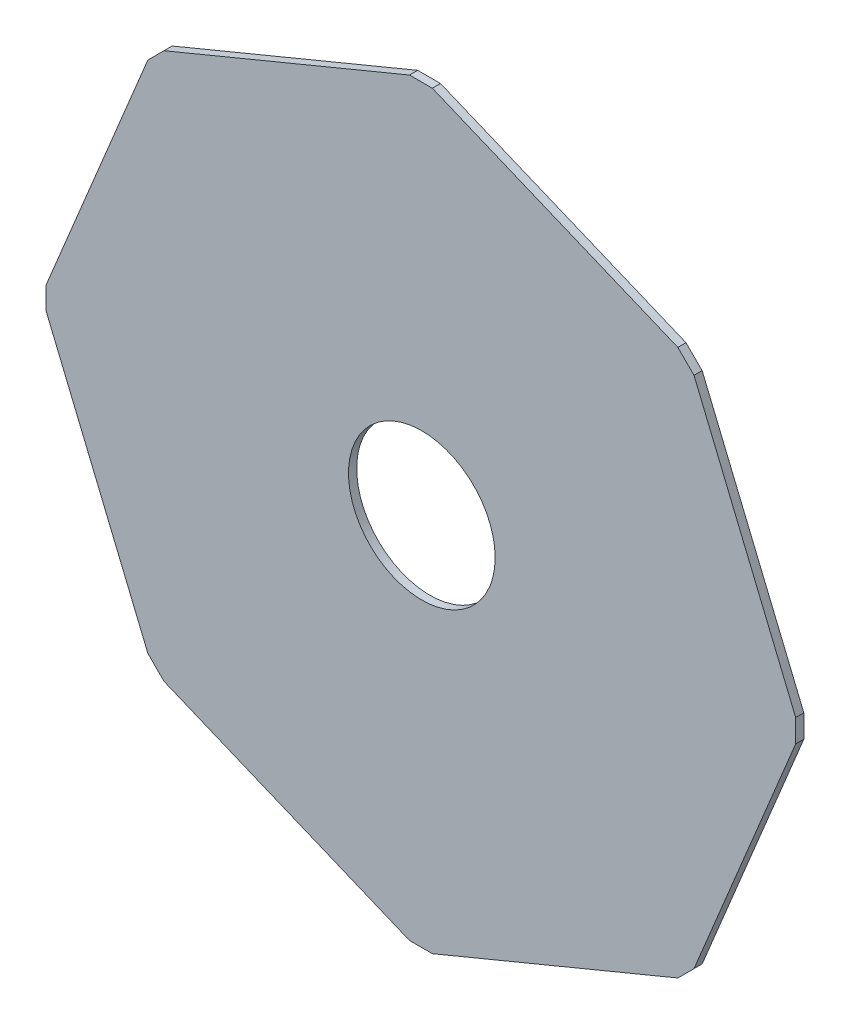
ISO-10303-21;
HEADER;
FILE_DESCRIPTION(('STEP AP214'),'2;1');
FILE_NAME('part.step','',(''),(''),'','','');
FILE_SCHEMA(('AUTOMOTIVE_DESIGN { 1 0 10303 214 1 1 1 1 }'));
ENDSEC;
DATA;
#1=APPLICATION_CONTEXT('core data for automotive mechanical design processes');
#2=APPLICATION_PROTOCOL_DEFINITION('international standard','automotive_design',2000,#1);
#3=PRODUCT_CONTEXT('',#1,'mechanical');
#4=PRODUCT('Part','Part','',(#3));
#5=PRODUCT_RELATED_PRODUCT_CATEGORY('part','',(#4));
#6=PRODUCT_DEFINITION_FORMATION('','',#4);
#7=PRODUCT_DEFINITION_CONTEXT('part definition',#1,'design');
#8=PRODUCT_DEFINITION('design','',#6,#7);
#9=PRODUCT_DEFINITION_SHAPE('','',#8);
#10=(LENGTH_UNIT() NAMED_UNIT(*) SI_UNIT(.MILLI.,.METRE.));
#11=(NAMED_UNIT(*) PLANE_ANGLE_UNIT() SI_UNIT($,.RADIAN.));
#12=(NAMED_UNIT(*) SI_UNIT($,.STERADIAN.) SOLID_ANGLE_UNIT());
#13=UNCERTAINTY_MEASURE_WITH_UNIT(LENGTH_MEASURE(1.E-05),#10,'distance_accuracy_value','');
#14=(GEOMETRIC_REPRESENTATION_CONTEXT(3) GLOBAL_UNCERTAINTY_ASSIGNED_CONTEXT((#13)) GLOBAL_UNIT_ASSIGNED_CONTEXT((#10,
#11,#12)) REPRESENTATION_CONTEXT('',''));
#15=CARTESIAN_POINT('',(0.,0.,0.));
#16=DIRECTION('',(0.,0.,1.));
#17=DIRECTION('',(1.,0.,0.));
#18=AXIS2_PLACEMENT_3D('',#15,#16,#17);
#19=CARTESIAN_POINT('',(0.,0.,5.));
#20=DIRECTION('',(0.,0.,1.));
#21=DIRECTION('',(1.,0.,0.));
#22=AXIS2_PLACEMENT_3D('',#19,#20,#21);
#23=PLANE('',#22);
#24=DIRECTION('',(0.,-1.,0.));
#25=VECTOR('',#24,1.);
#26=CARTESIAN_POINT('',(-230.557942617036,7.27897130849087,5.));
#27=LINE('',#26,#25);
#28=CARTESIAN_POINT('',(-230.557942617036,7.27897130849087,5.));
#29=VERTEX_POINT('',#28);
#30=CARTESIAN_POINT('',(-230.557942617036,-6.7210286914996,5.));
#31=VERTEX_POINT('',#30);
#32=EDGE_CURVE('E211',#29,#31,#27,.T.);
#33=ORIENTED_EDGE('',*,*,#32,.T.);
#34=DIRECTION('',(0.382683432365128,-0.923879532511271,0.));
#35=VECTOR('',#34,1.);
#36=CARTESIAN_POINT('',(-230.557942617036,-6.7210286914996,5.));
#37=LINE('',#36,#35);
#38=CARTESIAN_POINT('',(-168.142249758237,-157.405840896109,5.));
#39=VERTEX_POINT('',#38);
#40=EDGE_CURVE('E119',#31,#39,#37,.T.);
#41=ORIENTED_EDGE('',*,*,#40,.T.);
#42=DIRECTION('',(0.707106781186801,-0.707106781186294,0.));
#43=VECTOR('',#42,1.);
#44=CARTESIAN_POINT('',(-168.142249758237,-157.405840896109,5.));
#45=LINE('',#44,#43);
#46=CARTESIAN_POINT('',(-158.242754821622,-167.305335832717,5.));
#47=VERTEX_POINT('',#46);
#48=EDGE_CURVE('E250',#39,#47,#45,.T.);
#49=ORIENTED_EDGE('',*,*,#48,.T.);
#50=DIRECTION('',(0.923879532511295,-0.382683432365069,0.));
#51=VECTOR('',#50,1.);
#52=CARTESIAN_POINT('',(-158.242754821622,-167.305335832717,5.));
#53=LINE('',#52,#51);
#54=CARTESIAN_POINT('',(-7.55794261702294,-229.721028691501,5.));
#55=VERTEX_POINT('',#54);
#56=EDGE_CURVE('E269',#47,#55,#53,.T.);
#57=ORIENTED_EDGE('',*,*,#56,.T.);
#58=DIRECTION('',(1.,0.,0.));
#59=VECTOR('',#58,1.);
#60=CARTESIAN_POINT('',(-7.55794261702294,-229.721028691501,5.));
#61=LINE('',#60,#59);
#62=CARTESIAN_POINT('',(6.4420573829764,-229.721028691501,5.));
#63=VERTEX_POINT('',#62);
#64=EDGE_CURVE('E266',#55,#63,#61,.T.);
#65=ORIENTED_EDGE('',*,*,#64,.T.);
#66=DIRECTION('',(0.923879532511268,0.382683432365135,0.));
#67=VECTOR('',#66,1.);
#68=CARTESIAN_POINT('',(6.4420573829764,-229.721028691501,5.));
#69=LINE('',#68,#67);
#70=CARTESIAN_POINT('',(157.126869587579,-167.305335832703,5.));
#71=VERTEX_POINT('',#70);
#72=EDGE_CURVE('E268',#63,#71,#69,.T.);
#73=ORIENTED_EDGE('',*,*,#72,.T.);
#74=DIRECTION('',(0.707106781186548,0.707106781186548,0.));
#75=VECTOR('',#74,1.);
#76=CARTESIAN_POINT('',(157.126869587579,-167.305335832703,5.));
#77=LINE('',#76,#75);
#78=CARTESIAN_POINT('',(167.026364524185,-157.405840896097,5.));
#79=VERTEX_POINT('',#78);
#80=EDGE_CURVE('E271',#71,#79,#77,.T.);
#81=ORIENTED_EDGE('',*,*,#80,.T.);
#82=DIRECTION('',(0.382683432365019,0.923879532511316,0.));
#83=VECTOR('',#82,1.);
#84=CARTESIAN_POINT('',(167.026364524185,-157.405840896097,5.));
#85=LINE('',#84,#83);
#86=CARTESIAN_POINT('',(229.442057382966,-6.72102869148158,5.));
#87=VERTEX_POINT('',#86);
#88=EDGE_CURVE('E277',#79,#87,#85,.T.);
#89=ORIENTED_EDGE('',*,*,#88,.T.);
#90=DIRECTION('',(0.,1.,0.));
#91=VECTOR('',#90,1.);
#92=CARTESIAN_POINT('',(229.442057382966,-6.72102869148158,5.));
#93=LINE('',#92,#91);
#94=CARTESIAN_POINT('',(229.442057382966,7.27897130850405,5.));
#95=VERTEX_POINT('',#94);
#96=EDGE_CURVE('E279',#87,#95,#93,.T.);
#97=ORIENTED_EDGE('',*,*,#96,.T.);
#98=DIRECTION('',(-0.38268343236497,0.923879532511336,0.));
#99=VECTOR('',#98,1.);
#100=CARTESIAN_POINT('',(229.442057382966,7.27897130850405,5.));
#101=LINE('',#100,#99);
#102=CARTESIAN_POINT('',(167.026364524201,157.963783513104,5.));
#103=VERTEX_POINT('',#102);
#104=EDGE_CURVE('E281',#95,#103,#101,.T.);
#105=ORIENTED_EDGE('',*,*,#104,.T.);
#106=DIRECTION('',(-0.707106781186548,0.707106781186548,0.));
#107=VECTOR('',#106,1.);
#108=CARTESIAN_POINT('',(167.026364524201,157.963783513104,5.));
#109=LINE('',#108,#107);
#110=CARTESIAN_POINT('',(157.126869587596,167.863278449709,5.));
#111=VERTEX_POINT('',#110);
#112=EDGE_CURVE('E283',#103,#111,#109,.T.);
#113=ORIENTED_EDGE('',*,*,#112,.T.);
#114=DIRECTION('',(-0.923879532511311,0.38268343236503,0.));
#115=VECTOR('',#114,1.);
#116=CARTESIAN_POINT('',(157.126869587596,167.863278449709,5.));
#117=LINE('',#116,#115);
#118=CARTESIAN_POINT('',(6.44205738297554,230.278971308494,5.));
#119=VERTEX_POINT('',#118);
#120=EDGE_CURVE('E285',#111,#119,#117,.T.);
#121=ORIENTED_EDGE('',*,*,#120,.T.);
#122=DIRECTION('',(-1.,0.,0.));
#123=VECTOR('',#122,1.);
#124=CARTESIAN_POINT('',(6.44205738297554,230.278971308494,5.));
#125=LINE('',#124,#123);
#126=CARTESIAN_POINT('',(-7.55794261702026,230.278971308494,5.));
#127=VERTEX_POINT('',#126);
#128=EDGE_CURVE('E162',#119,#127,#125,.T.);
#129=ORIENTED_EDGE('',*,*,#128,.T.);
#130=DIRECTION('',(-0.923879532511271,-0.382683432365128,0.));
#131=VECTOR('',#130,1.);
#132=CARTESIAN_POINT('',(-7.55794261702026,230.278971308494,5.));
#133=LINE('',#132,#131);
#134=CARTESIAN_POINT('',(-158.24275482163,167.863278449695,5.));
#135=VERTEX_POINT('',#134);
#136=EDGE_CURVE('E156',#127,#135,#133,.T.);
#137=ORIENTED_EDGE('',*,*,#136,.T.);
#138=DIRECTION('',(-0.707106781186548,-0.707106781186548,0.));
#139=VECTOR('',#138,1.);
#140=CARTESIAN_POINT('',(-158.24275482163,167.863278449695,5.));
#141=LINE('',#140,#139);
#142=CARTESIAN_POINT('',(-168.142249758279,157.963783513045,5.));
#143=VERTEX_POINT('',#142);
#144=EDGE_CURVE('E160',#135,#143,#141,.T.);
#145=ORIENTED_EDGE('',*,*,#144,.T.);
#146=DIRECTION('',(-0.382683432365024,-0.923879532511314,0.));
#147=VECTOR('',#146,1.);
#148=CARTESIAN_POINT('',(-168.142249758279,157.963783513045,5.));
#149=LINE('',#148,#147);
#150=EDGE_CURVE('E52',#143,#29,#149,.T.);
#151=ORIENTED_EDGE('',*,*,#150,.T.);
#152=EDGE_LOOP('',(#33,#41,#49,#57,#65,#73,#81,#89,#97,#105,#113,#121,#129,#137,#145,#151));
#153=FACE_BOUND('',#152,.T.);
#154=CARTESIAN_POINT('',(0.,0.,5.));
#155=DIRECTION('',(0.,0.,1.));
#156=DIRECTION('',(1.,0.,0.));
#157=AXIS2_PLACEMENT_3D('',#154,#155,#156);
#158=CIRCLE('',#157,45.);
#159=CARTESIAN_POINT('',(45.,0.,5.));
#160=VERTEX_POINT('',#159);
#161=EDGE_CURVE('E184',#160,#160,#158,.T.);
#162=ORIENTED_EDGE('',*,*,#161,.F.);
#163=EDGE_LOOP('',(#162));
#164=FACE_BOUND('',#163,.T.);
#165=ADVANCED_FACE('F35',(#153,#164),#23,.T.);
#166=CARTESIAN_POINT('',(0.,0.,0.));
#167=DIRECTION('',(0.,0.,1.));
#168=DIRECTION('',(1.,0.,0.));
#169=AXIS2_PLACEMENT_3D('',#166,#167,#168);
#170=PLANE('',#169);
#171=DIRECTION('',(0.,-1.,0.));
#172=VECTOR('',#171,1.);
#173=CARTESIAN_POINT('',(-230.557942617036,7.27897130849087,0.));
#174=LINE('',#173,#172);
#175=CARTESIAN_POINT('',(-230.557942617036,7.27897130849087,0.));
#176=VERTEX_POINT('',#175);
#177=CARTESIAN_POINT('',(-230.557942617036,-6.7210286914996,0.));
#178=VERTEX_POINT('',#177);
#179=EDGE_CURVE('E180',#176,#178,#174,.T.);
#180=ORIENTED_EDGE('',*,*,#179,.F.);
#181=DIRECTION('',(-0.382683432365024,-0.923879532511314,0.));
#182=VECTOR('',#181,1.);
#183=CARTESIAN_POINT('',(-168.142249758279,157.963783513045,0.));
#184=LINE('',#183,#182);
#185=CARTESIAN_POINT('',(-168.142249758279,157.963783513045,0.));
#186=VERTEX_POINT('',#185);
#187=EDGE_CURVE('E111',#186,#176,#184,.T.);
#188=ORIENTED_EDGE('',*,*,#187,.F.);
#189=DIRECTION('',(-0.707106781186548,-0.707106781186548,0.));
#190=VECTOR('',#189,1.);
#191=CARTESIAN_POINT('',(-158.24275482163,167.863278449695,0.));
#192=LINE('',#191,#190);
#193=CARTESIAN_POINT('',(-158.24275482163,167.863278449695,0.));
#194=VERTEX_POINT('',#193);
#195=EDGE_CURVE('E105',#194,#186,#192,.T.);
#196=ORIENTED_EDGE('',*,*,#195,.F.);
#197=DIRECTION('',(-0.923879532511271,-0.382683432365128,0.));
#198=VECTOR('',#197,1.);
#199=CARTESIAN_POINT('',(-7.55794261702026,230.278971308494,0.));
#200=LINE('',#199,#198);
#201=CARTESIAN_POINT('',(-7.55794261702026,230.278971308494,0.));
#202=VERTEX_POINT('',#201);
#203=EDGE_CURVE('E170',#202,#194,#200,.T.);
#204=ORIENTED_EDGE('',*,*,#203,.F.);
#205=DIRECTION('',(-1.,0.,0.));
#206=VECTOR('',#205,1.);
#207=CARTESIAN_POINT('',(6.44205738297554,230.278971308494,0.));
#208=LINE('',#207,#206);
#209=CARTESIAN_POINT('',(6.44205738297554,230.278971308494,0.));
#210=VERTEX_POINT('',#209);
#211=EDGE_CURVE('E206',#210,#202,#208,.T.);
#212=ORIENTED_EDGE('',*,*,#211,.F.);
#213=DIRECTION('',(-0.923879532511311,0.38268343236503,0.));
#214=VECTOR('',#213,1.);
#215=CARTESIAN_POINT('',(157.126869587596,167.863278449709,0.));
#216=LINE('',#215,#214);
#217=CARTESIAN_POINT('',(157.126869587596,167.863278449709,0.));
#218=VERTEX_POINT('',#217);
#219=EDGE_CURVE('E204',#218,#210,#216,.T.);
#220=ORIENTED_EDGE('',*,*,#219,.F.);
#221=DIRECTION('',(-0.707106781186548,0.707106781186548,0.));
#222=VECTOR('',#221,1.);
#223=CARTESIAN_POINT('',(167.026364524201,157.963783513104,0.));
#224=LINE('',#223,#222);
#225=CARTESIAN_POINT('',(167.026364524201,157.963783513104,0.));
#226=VERTEX_POINT('',#225);
#227=EDGE_CURVE('E202',#226,#218,#224,.T.);
#228=ORIENTED_EDGE('',*,*,#227,.F.);
#229=DIRECTION('',(-0.38268343236497,0.923879532511336,0.));
#230=VECTOR('',#229,1.);
#231=CARTESIAN_POINT('',(229.442057382966,7.27897130850405,0.));
#232=LINE('',#231,#230);
#233=CARTESIAN_POINT('',(229.442057382966,7.27897130850405,0.));
#234=VERTEX_POINT('',#233);
#235=EDGE_CURVE('E200',#234,#226,#232,.T.);
#236=ORIENTED_EDGE('',*,*,#235,.F.);
#237=DIRECTION('',(0.,1.,0.));
#238=VECTOR('',#237,1.);
#239=CARTESIAN_POINT('',(229.442057382966,-6.72102869148158,0.));
#240=LINE('',#239,#238);
#241=CARTESIAN_POINT('',(229.442057382966,-6.72102869148158,0.));
#242=VERTEX_POINT('',#241);
#243=EDGE_CURVE('E198',#242,#234,#240,.T.);
#244=ORIENTED_EDGE('',*,*,#243,.F.);
#245=DIRECTION('',(0.382683432365019,0.923879532511316,0.));
#246=VECTOR('',#245,1.);
#247=CARTESIAN_POINT('',(167.026364524185,-157.405840896097,0.));
#248=LINE('',#247,#246);
#249=CARTESIAN_POINT('',(167.026364524185,-157.405840896097,0.));
#250=VERTEX_POINT('',#249);
#251=EDGE_CURVE('E196',#250,#242,#248,.T.);
#252=ORIENTED_EDGE('',*,*,#251,.F.);
#253=DIRECTION('',(0.707106781186548,0.707106781186548,0.));
#254=VECTOR('',#253,1.);
#255=CARTESIAN_POINT('',(157.126869587579,-167.305335832703,0.));
#256=LINE('',#255,#254);
#257=CARTESIAN_POINT('',(157.126869587579,-167.305335832703,0.));
#258=VERTEX_POINT('',#257);
#259=EDGE_CURVE('E194',#258,#250,#256,.T.);
#260=ORIENTED_EDGE('',*,*,#259,.F.);
#261=DIRECTION('',(0.923879532511268,0.382683432365135,0.));
#262=VECTOR('',#261,1.);
#263=CARTESIAN_POINT('',(6.4420573829764,-229.721028691501,0.));
#264=LINE('',#263,#262);
#265=CARTESIAN_POINT('',(6.4420573829764,-229.721028691501,0.));
#266=VERTEX_POINT('',#265);
#267=EDGE_CURVE('E192',#266,#258,#264,.T.);
#268=ORIENTED_EDGE('',*,*,#267,.F.);
#269=DIRECTION('',(1.,0.,0.));
#270=VECTOR('',#269,1.);
#271=CARTESIAN_POINT('',(-7.55794261702294,-229.721028691501,0.));
#272=LINE('',#271,#270);
#273=CARTESIAN_POINT('',(-7.55794261702294,-229.721028691501,0.));
#274=VERTEX_POINT('',#273);
#275=EDGE_CURVE('E190',#274,#266,#272,.T.);
#276=ORIENTED_EDGE('',*,*,#275,.F.);
#277=DIRECTION('',(0.923879532511295,-0.382683432365069,0.));
#278=VECTOR('',#277,1.);
#279=CARTESIAN_POINT('',(-158.242754821622,-167.305335832717,0.));
#280=LINE('',#279,#278);
#281=CARTESIAN_POINT('',(-158.242754821622,-167.305335832717,0.));
#282=VERTEX_POINT('',#281);
#283=EDGE_CURVE('E188',#282,#274,#280,.T.);
#284=ORIENTED_EDGE('',*,*,#283,.F.);
#285=DIRECTION('',(0.707106781186801,-0.707106781186294,0.));
#286=VECTOR('',#285,1.);
#287=CARTESIAN_POINT('',(-168.142249758237,-157.405840896109,0.));
#288=LINE('',#287,#286);
#289=CARTESIAN_POINT('',(-168.142249758237,-157.405840896109,0.));
#290=VERTEX_POINT('',#289);
#291=EDGE_CURVE('E186',#290,#282,#288,.T.);
#292=ORIENTED_EDGE('',*,*,#291,.F.);
#293=DIRECTION('',(0.382683432365128,-0.923879532511271,0.));
#294=VECTOR('',#293,1.);
#295=CARTESIAN_POINT('',(-230.557942617036,-6.7210286914996,0.));
#296=LINE('',#295,#294);
#297=EDGE_CURVE('E183',#178,#290,#296,.T.);
#298=ORIENTED_EDGE('',*,*,#297,.F.);
#299=EDGE_LOOP('',(#180,#188,#196,#204,#212,#220,#228,#236,#244,#252,#260,#268,#276,#284,#292,#298));
#300=FACE_BOUND('',#299,.T.);
#301=CARTESIAN_POINT('',(0.,0.,0.));
#302=DIRECTION('',(0.,0.,1.));
#303=DIRECTION('',(1.,0.,0.));
#304=AXIS2_PLACEMENT_3D('',#301,#302,#303);
#305=CIRCLE('',#304,45.);
#306=CARTESIAN_POINT('',(45.,0.,0.));
#307=VERTEX_POINT('',#306);
#308=EDGE_CURVE('E484',#307,#307,#305,.T.);
#309=ORIENTED_EDGE('',*,*,#308,.T.);
#310=EDGE_LOOP('',(#309));
#311=FACE_BOUND('',#310,.T.);
#312=ADVANCED_FACE('F254',(#300,#311),#170,.F.);
#313=CARTESIAN_POINT('',(-230.557942617036,7.27897130849087,5.));
#314=DIRECTION('',(1.,0.,0.));
#315=DIRECTION('',(0.,0.,-1.));
#316=AXIS2_PLACEMENT_3D('',#313,#314,#315);
#317=PLANE('',#316);
#318=ORIENTED_EDGE('',*,*,#179,.T.);
#319=DIRECTION('',(0.,0.,-1.));
#320=VECTOR('',#319,1.);
#321=CARTESIAN_POINT('',(-230.557942617036,-6.7210286914996,5.));
#322=LINE('',#321,#320);
#323=EDGE_CURVE('E11',#31,#178,#322,.T.);
#324=ORIENTED_EDGE('',*,*,#323,.F.);
#325=ORIENTED_EDGE('',*,*,#32,.F.);
#326=DIRECTION('',(0.,0.,-1.));
#327=VECTOR('',#326,1.);
#328=CARTESIAN_POINT('',(-230.557942617036,7.27897130849087,5.));
#329=LINE('',#328,#327);
#330=EDGE_CURVE('E176',#29,#176,#329,.T.);
#331=ORIENTED_EDGE('',*,*,#330,.T.);
#332=EDGE_LOOP('',(#318,#324,#325,#331));
#333=FACE_BOUND('',#332,.T.);
#334=ADVANCED_FACE('F37',(#333),#317,.F.);
#335=CARTESIAN_POINT('',(-230.557942617036,-6.7210286914996,5.));
#336=DIRECTION('',(0.923879532511271,0.382683432365128,0.));
#337=DIRECTION('',(-0.382683432365128,0.923879532511271,0.));
#338=AXIS2_PLACEMENT_3D('',#335,#336,#337);
#339=PLANE('',#338);
#340=ORIENTED_EDGE('',*,*,#297,.T.);
#341=DIRECTION('',(0.,0.,-1.));
#342=VECTOR('',#341,1.);
#343=CARTESIAN_POINT('',(-168.142249758237,-157.405840896109,5.));
#344=LINE('',#343,#342);
#345=EDGE_CURVE('E44',#39,#290,#344,.T.);
#346=ORIENTED_EDGE('',*,*,#345,.F.);
#347=ORIENTED_EDGE('',*,*,#40,.F.);
#348=ORIENTED_EDGE('',*,*,#323,.T.);
#349=EDGE_LOOP('',(#340,#346,#347,#348));
#350=FACE_BOUND('',#349,.T.);
#351=ADVANCED_FACE('F319',(#350),#339,.F.);
#352=CARTESIAN_POINT('',(-168.142249758237,-157.405840896109,5.));
#353=DIRECTION('',(0.707106781186294,0.707106781186801,0.));
#354=DIRECTION('',(-0.707106781186801,0.707106781186294,0.));
#355=AXIS2_PLACEMENT_3D('',#352,#353,#354);
#356=PLANE('',#355);
#357=ORIENTED_EDGE('',*,*,#291,.T.);
#358=DIRECTION('',(0.,0.,-1.));
#359=VECTOR('',#358,1.);
#360=CARTESIAN_POINT('',(-158.242754821622,-167.305335832717,5.));
#361=LINE('',#360,#359);
#362=EDGE_CURVE('E242',#47,#282,#361,.T.);
#363=ORIENTED_EDGE('',*,*,#362,.F.);
#364=ORIENTED_EDGE('',*,*,#48,.F.);
#365=ORIENTED_EDGE('',*,*,#345,.T.);
#366=EDGE_LOOP('',(#357,#363,#364,#365));
#367=FACE_BOUND('',#366,.T.);
#368=ADVANCED_FACE('F248',(#367),#356,.F.);
#369=CARTESIAN_POINT('',(-158.242754821622,-167.305335832717,5.));
#370=DIRECTION('',(0.382683432365069,0.923879532511296,0.));
#371=DIRECTION('',(-0.923879532511296,0.382683432365069,0.));
#372=AXIS2_PLACEMENT_3D('',#369,#370,#371);
#373=PLANE('',#372);
#374=ORIENTED_EDGE('',*,*,#283,.T.);
#375=DIRECTION('',(0.,0.,-1.));
#376=VECTOR('',#375,1.);
#377=CARTESIAN_POINT('',(-7.55794261702294,-229.721028691501,5.));
#378=LINE('',#377,#376);
#379=EDGE_CURVE('E239',#55,#274,#378,.T.);
#380=ORIENTED_EDGE('',*,*,#379,.F.);
#381=ORIENTED_EDGE('',*,*,#56,.F.);
#382=ORIENTED_EDGE('',*,*,#362,.T.);
#383=EDGE_LOOP('',(#374,#380,#381,#382));
#384=FACE_BOUND('',#383,.T.);
#385=ADVANCED_FACE('F260',(#384),#373,.F.);
#386=CARTESIAN_POINT('',(-7.55794261702294,-229.721028691501,5.));
#387=DIRECTION('',(0.,1.,0.));
#388=DIRECTION('',(0.,0.,1.));
#389=AXIS2_PLACEMENT_3D('',#386,#387,#388);
#390=PLANE('',#389);
#391=ORIENTED_EDGE('',*,*,#275,.T.);
#392=DIRECTION('',(0.,0.,-1.));
#393=VECTOR('',#392,1.);
#394=CARTESIAN_POINT('',(6.4420573829764,-229.721028691501,5.));
#395=LINE('',#394,#393);
#396=EDGE_CURVE('E236',#63,#266,#395,.T.);
#397=ORIENTED_EDGE('',*,*,#396,.F.);
#398=ORIENTED_EDGE('',*,*,#64,.F.);
#399=ORIENTED_EDGE('',*,*,#379,.T.);
#400=EDGE_LOOP('',(#391,#397,#398,#399));
#401=FACE_BOUND('',#400,.T.);
#402=ADVANCED_FACE('F264',(#401),#390,.F.);
#403=CARTESIAN_POINT('',(6.4420573829764,-229.721028691501,5.));
#404=DIRECTION('',(-0.382683432365135,0.923879532511268,0.));
#405=DIRECTION('',(-0.923879532511268,-0.382683432365135,0.));
#406=AXIS2_PLACEMENT_3D('',#403,#404,#405);
#407=PLANE('',#406);
#408=ORIENTED_EDGE('',*,*,#267,.T.);
#409=DIRECTION('',(0.,0.,-1.));
#410=VECTOR('',#409,1.);
#411=CARTESIAN_POINT('',(157.126869587579,-167.305335832703,5.));
#412=LINE('',#411,#410);
#413=EDGE_CURVE('E233',#71,#258,#412,.T.);
#414=ORIENTED_EDGE('',*,*,#413,.F.);
#415=ORIENTED_EDGE('',*,*,#72,.F.);
#416=ORIENTED_EDGE('',*,*,#396,.T.);
#417=EDGE_LOOP('',(#408,#414,#415,#416));
#418=FACE_BOUND('',#417,.T.);
#419=ADVANCED_FACE('F332',(#418),#407,.F.);
#420=CARTESIAN_POINT('',(157.126869587579,-167.305335832703,5.));
#421=DIRECTION('',(-0.707106781186548,0.707106781186548,0.));
#422=DIRECTION('',(-0.707106781186548,-0.707106781186548,0.));
#423=AXIS2_PLACEMENT_3D('',#420,#421,#422);
#424=PLANE('',#423);
#425=ORIENTED_EDGE('',*,*,#259,.T.);
#426=DIRECTION('',(0.,0.,-1.));
#427=VECTOR('',#426,1.);
#428=CARTESIAN_POINT('',(167.026364524185,-157.405840896097,5.));
#429=LINE('',#428,#427);
#430=EDGE_CURVE('E230',#79,#250,#429,.T.);
#431=ORIENTED_EDGE('',*,*,#430,.F.);
#432=ORIENTED_EDGE('',*,*,#80,.F.);
#433=ORIENTED_EDGE('',*,*,#413,.T.);
#434=EDGE_LOOP('',(#425,#431,#432,#433));
#435=FACE_BOUND('',#434,.T.);
#436=ADVANCED_FACE('F335',(#435),#424,.F.);
#437=CARTESIAN_POINT('',(167.026364524185,-157.405840896097,5.));
#438=DIRECTION('',(-0.923879532511316,0.382683432365019,0.));
#439=DIRECTION('',(-0.382683432365019,-0.923879532511316,0.));
#440=AXIS2_PLACEMENT_3D('',#437,#438,#439);
#441=PLANE('',#440);
#442=ORIENTED_EDGE('',*,*,#251,.T.);
#443=DIRECTION('',(0.,0.,-1.));
#444=VECTOR('',#443,1.);
#445=CARTESIAN_POINT('',(229.442057382966,-6.72102869148158,5.));
#446=LINE('',#445,#444);
#447=EDGE_CURVE('E227',#87,#242,#446,.T.);
#448=ORIENTED_EDGE('',*,*,#447,.F.);
#449=ORIENTED_EDGE('',*,*,#88,.F.);
#450=ORIENTED_EDGE('',*,*,#430,.T.);
#451=EDGE_LOOP('',(#442,#448,#449,#450));
#452=FACE_BOUND('',#451,.T.);
#453=ADVANCED_FACE('F339',(#452),#441,.F.);
#454=CARTESIAN_POINT('',(229.442057382966,-6.72102869148158,5.));
#455=DIRECTION('',(-1.,0.,0.));
#456=DIRECTION('',(0.,0.,1.));
#457=AXIS2_PLACEMENT_3D('',#454,#455,#456);
#458=PLANE('',#457);
#459=ORIENTED_EDGE('',*,*,#243,.T.);
#460=DIRECTION('',(0.,0.,-1.));
#461=VECTOR('',#460,1.);
#462=CARTESIAN_POINT('',(229.442057382966,7.27897130850405,5.));
#463=LINE('',#462,#461);
#464=EDGE_CURVE('E224',#95,#234,#463,.T.);
#465=ORIENTED_EDGE('',*,*,#464,.F.);
#466=ORIENTED_EDGE('',*,*,#96,.F.);
#467=ORIENTED_EDGE('',*,*,#447,.T.);
#468=EDGE_LOOP('',(#459,#465,#466,#467));
#469=FACE_BOUND('',#468,.T.);
#470=ADVANCED_FACE('F343',(#469),#458,.F.);
#471=CARTESIAN_POINT('',(229.442057382966,7.27897130850405,5.));
#472=DIRECTION('',(-0.923879532511336,-0.38268343236497,0.));
#473=DIRECTION('',(0.38268343236497,-0.923879532511336,0.));
#474=AXIS2_PLACEMENT_3D('',#471,#472,#473);
#475=PLANE('',#474);
#476=ORIENTED_EDGE('',*,*,#235,.T.);
#477=DIRECTION('',(0.,0.,-1.));
#478=VECTOR('',#477,1.);
#479=CARTESIAN_POINT('',(167.026364524201,157.963783513104,5.));
#480=LINE('',#479,#478);
#481=EDGE_CURVE('E221',#103,#226,#480,.T.);
#482=ORIENTED_EDGE('',*,*,#481,.F.);
#483=ORIENTED_EDGE('',*,*,#104,.F.);
#484=ORIENTED_EDGE('',*,*,#464,.T.);
#485=EDGE_LOOP('',(#476,#482,#483,#484));
#486=FACE_BOUND('',#485,.T.);
#487=ADVANCED_FACE('F347',(#486),#475,.F.);
#488=CARTESIAN_POINT('',(167.026364524201,157.963783513104,5.));
#489=DIRECTION('',(-0.707106781186548,-0.707106781186548,0.));
#490=DIRECTION('',(0.707106781186548,-0.707106781186548,0.));
#491=AXIS2_PLACEMENT_3D('',#488,#489,#490);
#492=PLANE('',#491);
#493=ORIENTED_EDGE('',*,*,#227,.T.);
#494=DIRECTION('',(0.,0.,-1.));
#495=VECTOR('',#494,1.);
#496=CARTESIAN_POINT('',(157.126869587596,167.863278449709,5.));
#497=LINE('',#496,#495);
#498=EDGE_CURVE('E218',#111,#218,#497,.T.);
#499=ORIENTED_EDGE('',*,*,#498,.F.);
#500=ORIENTED_EDGE('',*,*,#112,.F.);
#501=ORIENTED_EDGE('',*,*,#481,.T.);
#502=EDGE_LOOP('',(#493,#499,#500,#501));
#503=FACE_BOUND('',#502,.T.);
#504=ADVANCED_FACE('F351',(#503),#492,.F.);
#505=CARTESIAN_POINT('',(157.126869587596,167.863278449709,5.));
#506=DIRECTION('',(-0.38268343236503,-0.923879532511311,0.));
#507=DIRECTION('',(0.923879532511311,-0.38268343236503,0.));
#508=AXIS2_PLACEMENT_3D('',#505,#506,#507);
#509=PLANE('',#508);
#510=ORIENTED_EDGE('',*,*,#219,.T.);
#511=DIRECTION('',(0.,0.,-1.));
#512=VECTOR('',#511,1.);
#513=CARTESIAN_POINT('',(6.44205738297554,230.278971308494,5.));
#514=LINE('',#513,#512);
#515=EDGE_CURVE('E215',#119,#210,#514,.T.);
#516=ORIENTED_EDGE('',*,*,#515,.F.);
#517=ORIENTED_EDGE('',*,*,#120,.F.);
#518=ORIENTED_EDGE('',*,*,#498,.T.);
#519=EDGE_LOOP('',(#510,#516,#517,#518));
#520=FACE_BOUND('',#519,.T.);
#521=ADVANCED_FACE('F291',(#520),#509,.F.);
#522=CARTESIAN_POINT('',(6.44205738297554,230.278971308494,5.));
#523=DIRECTION('',(0.,-1.,0.));
#524=DIRECTION('',(0.,0.,-1.));
#525=AXIS2_PLACEMENT_3D('',#522,#523,#524);
#526=PLANE('',#525);
#527=ORIENTED_EDGE('',*,*,#211,.T.);
#528=DIRECTION('',(0.,0.,-1.));
#529=VECTOR('',#528,1.);
#530=CARTESIAN_POINT('',(-7.55794261702026,230.278971308494,5.));
#531=LINE('',#530,#529);
#532=EDGE_CURVE('E171',#127,#202,#531,.T.);
#533=ORIENTED_EDGE('',*,*,#532,.F.);
#534=ORIENTED_EDGE('',*,*,#128,.F.);
#535=ORIENTED_EDGE('',*,*,#515,.T.);
#536=EDGE_LOOP('',(#527,#533,#534,#535));
#537=FACE_BOUND('',#536,.T.);
#538=ADVANCED_FACE('F295',(#537),#526,.F.);
#539=CARTESIAN_POINT('',(-7.55794261702026,230.278971308494,5.));
#540=DIRECTION('',(0.382683432365128,-0.923879532511271,0.));
#541=DIRECTION('',(0.923879532511271,0.382683432365128,0.));
#542=AXIS2_PLACEMENT_3D('',#539,#540,#541);
#543=PLANE('',#542);
#544=ORIENTED_EDGE('',*,*,#203,.T.);
#545=DIRECTION('',(0.,0.,-1.));
#546=VECTOR('',#545,1.);
#547=CARTESIAN_POINT('',(-158.24275482163,167.863278449695,5.));
#548=LINE('',#547,#546);
#549=EDGE_CURVE('E167',#135,#194,#548,.T.);
#550=ORIENTED_EDGE('',*,*,#549,.F.);
#551=ORIENTED_EDGE('',*,*,#136,.F.);
#552=ORIENTED_EDGE('',*,*,#532,.T.);
#553=EDGE_LOOP('',(#544,#550,#551,#552));
#554=FACE_BOUND('',#553,.T.);
#555=ADVANCED_FACE('F168',(#554),#543,.F.);
#556=CARTESIAN_POINT('',(-158.24275482163,167.863278449695,5.));
#557=DIRECTION('',(0.707106781186548,-0.707106781186548,0.));
#558=DIRECTION('',(0.707106781186548,0.707106781186548,0.));
#559=AXIS2_PLACEMENT_3D('',#556,#557,#558);
#560=PLANE('',#559);
#561=ORIENTED_EDGE('',*,*,#195,.T.);
#562=DIRECTION('',(0.,0.,-1.));
#563=VECTOR('',#562,1.);
#564=CARTESIAN_POINT('',(-168.142249758279,157.963783513045,5.));
#565=LINE('',#564,#563);
#566=EDGE_CURVE('E172',#143,#186,#565,.T.);
#567=ORIENTED_EDGE('',*,*,#566,.F.);
#568=ORIENTED_EDGE('',*,*,#144,.F.);
#569=ORIENTED_EDGE('',*,*,#549,.T.);
#570=EDGE_LOOP('',(#561,#567,#568,#569));
#571=FACE_BOUND('',#570,.T.);
#572=ADVANCED_FACE('F174',(#571),#560,.F.);
#573=CARTESIAN_POINT('',(-168.142249758279,157.963783513045,5.));
#574=DIRECTION('',(0.923879532511314,-0.382683432365024,0.));
#575=DIRECTION('',(0.382683432365024,0.923879532511314,0.));
#576=AXIS2_PLACEMENT_3D('',#573,#574,#575);
#577=PLANE('',#576);
#578=ORIENTED_EDGE('',*,*,#187,.T.);
#579=ORIENTED_EDGE('',*,*,#330,.F.);
#580=ORIENTED_EDGE('',*,*,#150,.F.);
#581=ORIENTED_EDGE('',*,*,#566,.T.);
#582=EDGE_LOOP('',(#578,#579,#580,#581));
#583=FACE_BOUND('',#582,.T.);
#584=ADVANCED_FACE('F299',(#583),#577,.F.);
#585=CARTESIAN_POINT('',(0.,0.,5.));
#586=DIRECTION('',(0.,0.,-1.));
#587=DIRECTION('',(-1.,0.,0.));
#588=AXIS2_PLACEMENT_3D('',#585,#586,#587);
#589=CYLINDRICAL_SURFACE('',#588,45.);
#590=ORIENTED_EDGE('',*,*,#161,.T.);
#591=EDGE_LOOP('',(#590));
#592=FACE_BOUND('',#591,.T.);
#593=ORIENTED_EDGE('',*,*,#308,.F.);
#594=EDGE_LOOP('',(#593));
#595=FACE_BOUND('',#594,.T.);
#596=ADVANCED_FACE('F301',(#592,#595),#589,.F.);
#597=CLOSED_SHELL('',(#165,#312,#334,#351,#368,#385,#402,#419,#436,#453,#470,#487,#504,#521,
#538,#555,#572,#584,#596));
#598=MANIFOLD_SOLID_BREP('B2',#597);
#599=ADVANCED_BREP_SHAPE_REPRESENTATION('',(#18,#598),#14);
#600=SHAPE_DEFINITION_REPRESENTATION(#9,#599);
ENDSEC;
END-ISO-10303-21;
